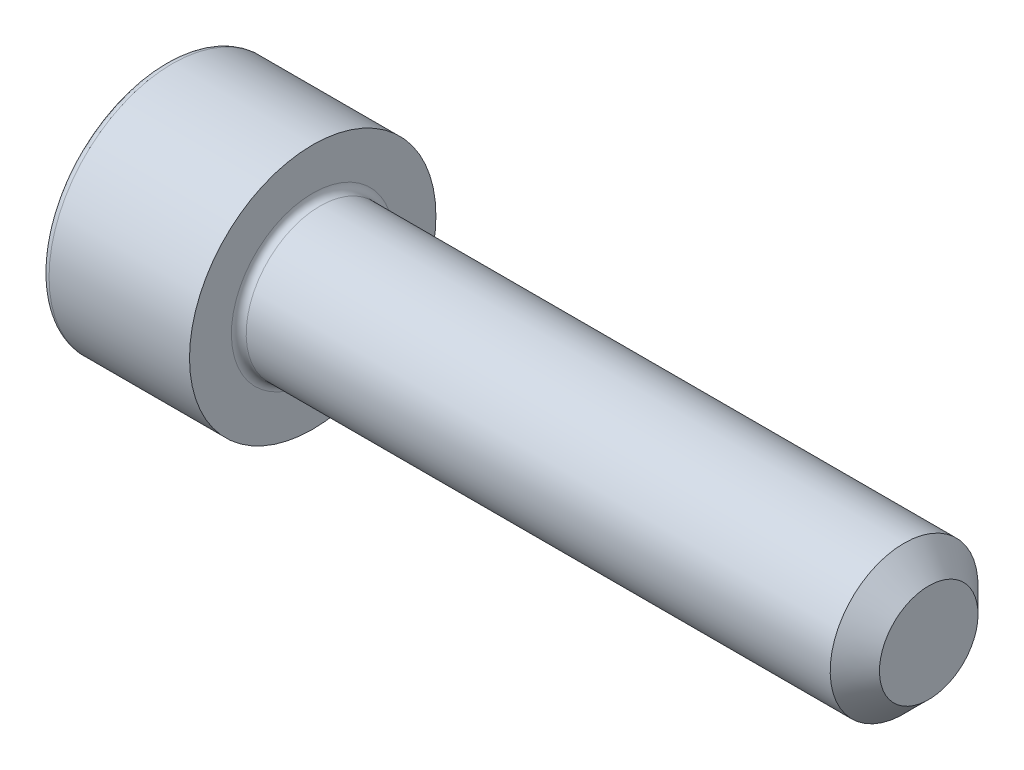
ISO-10303-21;
HEADER;
FILE_DESCRIPTION(('STEP AP214'),'2;1');
FILE_NAME('part.step','',(''),(''),'','','');
FILE_SCHEMA(('AUTOMOTIVE_DESIGN { 1 0 10303 214 1 1 1 1 }'));
ENDSEC;
DATA;
#1=APPLICATION_CONTEXT('core data for automotive mechanical design processes');
#2=APPLICATION_PROTOCOL_DEFINITION('international standard','automotive_design',2000,#1);
#3=PRODUCT_CONTEXT('',#1,'mechanical');
#4=PRODUCT('Part','Part','',(#3));
#5=PRODUCT_RELATED_PRODUCT_CATEGORY('part','',(#4));
#6=PRODUCT_DEFINITION_FORMATION('','',#4);
#7=PRODUCT_DEFINITION_CONTEXT('part definition',#1,'design');
#8=PRODUCT_DEFINITION('design','',#6,#7);
#9=PRODUCT_DEFINITION_SHAPE('','',#8);
#10=(LENGTH_UNIT() NAMED_UNIT(*) SI_UNIT(.MILLI.,.METRE.));
#11=(NAMED_UNIT(*) PLANE_ANGLE_UNIT() SI_UNIT($,.RADIAN.));
#12=(NAMED_UNIT(*) SI_UNIT($,.STERADIAN.) SOLID_ANGLE_UNIT());
#13=UNCERTAINTY_MEASURE_WITH_UNIT(LENGTH_MEASURE(1.E-05),#10,'distance_accuracy_value','');
#14=(GEOMETRIC_REPRESENTATION_CONTEXT(3) GLOBAL_UNCERTAINTY_ASSIGNED_CONTEXT((#13)) GLOBAL_UNIT_ASSIGNED_CONTEXT((#10,
#11,#12)) REPRESENTATION_CONTEXT('',''));
#15=CARTESIAN_POINT('',(0.,0.,0.));
#16=DIRECTION('',(0.,0.,1.));
#17=DIRECTION('',(1.,0.,0.));
#18=AXIS2_PLACEMENT_3D('',#15,#16,#17);
#19=CARTESIAN_POINT('',(0.,0.,0.));
#20=DIRECTION('',(-1.,0.,0.));
#21=DIRECTION('',(0.,-1.,0.));
#22=AXIS2_PLACEMENT_3D('',#19,#20,#21);
#23=PLANE('',#22);
#24=CARTESIAN_POINT('',(0.,0.,0.));
#25=DIRECTION('',(-1.,0.,0.));
#26=DIRECTION('',(0.,-1.,0.));
#27=AXIS2_PLACEMENT_3D('',#24,#25,#26);
#28=CIRCLE('',#27,4.7);
#29=CARTESIAN_POINT('',(0.,-4.7,0.));
#30=VERTEX_POINT('',#29);
#31=EDGE_CURVE('E158',#30,#30,#28,.T.);
#32=ORIENTED_EDGE('',*,*,#31,.T.);
#33=EDGE_LOOP('',(#32));
#34=FACE_BOUND('',#33,.T.);
#35=DIRECTION('',(0.,0.,-1.));
#36=VECTOR('',#35,1.);
#37=CARTESIAN_POINT('',(0.,2.5,1.44337567297407));
#38=LINE('',#37,#36);
#39=CARTESIAN_POINT('',(0.,2.5,1.44337567297407));
#40=VERTEX_POINT('',#39);
#41=CARTESIAN_POINT('',(0.,2.5,-1.44337567297406));
#42=VERTEX_POINT('',#41);
#43=EDGE_CURVE('E54',#40,#42,#38,.T.);
#44=ORIENTED_EDGE('',*,*,#43,.F.);
#45=DIRECTION('',(0.,0.866025403784439,-0.5));
#46=VECTOR('',#45,1.);
#47=CARTESIAN_POINT('',(0.,0.,2.88675134594813));
#48=LINE('',#47,#46);
#49=CARTESIAN_POINT('',(0.,0.,2.88675134594813));
#50=VERTEX_POINT('',#49);
#51=EDGE_CURVE('E137',#50,#40,#48,.T.);
#52=ORIENTED_EDGE('',*,*,#51,.F.);
#53=DIRECTION('',(0.,0.866025403784439,0.5));
#54=VECTOR('',#53,1.);
#55=CARTESIAN_POINT('',(0.,-2.5,1.44337567297406));
#56=LINE('',#55,#54);
#57=CARTESIAN_POINT('',(0.,-2.5,1.44337567297406));
#58=VERTEX_POINT('',#57);
#59=EDGE_CURVE('E135',#58,#50,#56,.T.);
#60=ORIENTED_EDGE('',*,*,#59,.F.);
#61=DIRECTION('',(0.,0.,1.));
#62=VECTOR('',#61,1.);
#63=CARTESIAN_POINT('',(0.,-2.5,-1.44337567297407));
#64=LINE('',#63,#62);
#65=CARTESIAN_POINT('',(0.,-2.5,-1.44337567297407));
#66=VERTEX_POINT('',#65);
#67=EDGE_CURVE('E102',#66,#58,#64,.T.);
#68=ORIENTED_EDGE('',*,*,#67,.F.);
#69=DIRECTION('',(0.,-0.866025403784439,0.5));
#70=VECTOR('',#69,1.);
#71=CARTESIAN_POINT('',(0.,0.,-2.88675134594813));
#72=LINE('',#71,#70);
#73=CARTESIAN_POINT('',(0.,0.,-2.88675134594813));
#74=VERTEX_POINT('',#73);
#75=EDGE_CURVE('E131',#74,#66,#72,.T.);
#76=ORIENTED_EDGE('',*,*,#75,.F.);
#77=DIRECTION('',(0.,-0.866025403784439,-0.5));
#78=VECTOR('',#77,1.);
#79=CARTESIAN_POINT('',(0.,2.5,-1.44337567297406));
#80=LINE('',#79,#78);
#81=EDGE_CURVE('E128',#42,#74,#80,.T.);
#82=ORIENTED_EDGE('',*,*,#81,.F.);
#83=EDGE_LOOP('',(#44,#52,#60,#68,#76,#82));
#84=FACE_BOUND('',#83,.T.);
#85=ADVANCED_FACE('F38',(#34,#84),#23,.T.);
#86=CARTESIAN_POINT('',(31.,0.,0.));
#87=DIRECTION('',(1.,0.,0.));
#88=DIRECTION('',(0.,1.,0.));
#89=AXIS2_PLACEMENT_3D('',#86,#87,#88);
#90=CYLINDRICAL_SURFACE('',#89,5.);
#91=CARTESIAN_POINT('',(0.300000000000002,0.,0.));
#92=DIRECTION('',(-1.,0.,0.));
#93=DIRECTION('',(0.,-1.,0.));
#94=AXIS2_PLACEMENT_3D('',#91,#92,#93);
#95=CIRCLE('',#94,5.);
#96=CARTESIAN_POINT('',(0.300000000000002,-5.,0.));
#97=VERTEX_POINT('',#96);
#98=EDGE_CURVE('E155',#97,#97,#95,.F.);
#99=ORIENTED_EDGE('',*,*,#98,.T.);
#100=EDGE_LOOP('',(#99));
#101=FACE_BOUND('',#100,.T.);
#102=CARTESIAN_POINT('',(6.,0.,0.));
#103=DIRECTION('',(1.,0.,0.));
#104=DIRECTION('',(0.,1.,0.));
#105=AXIS2_PLACEMENT_3D('',#102,#103,#104);
#106=CIRCLE('',#105,5.);
#107=CARTESIAN_POINT('',(6.,5.,0.));
#108=VERTEX_POINT('',#107);
#109=EDGE_CURVE('E141',#108,#108,#106,.T.);
#110=ORIENTED_EDGE('',*,*,#109,.F.);
#111=EDGE_LOOP('',(#110));
#112=FACE_BOUND('',#111,.T.);
#113=ADVANCED_FACE('F175',(#101,#112),#90,.T.);
#114=CARTESIAN_POINT('',(6.,5.,0.));
#115=DIRECTION('',(1.,0.,0.));
#116=DIRECTION('',(0.,1.,0.));
#117=AXIS2_PLACEMENT_3D('',#114,#115,#116);
#118=PLANE('',#117);
#119=CARTESIAN_POINT('',(6.,0.,0.));
#120=DIRECTION('',(1.,0.,0.));
#121=DIRECTION('',(0.,1.,0.));
#122=AXIS2_PLACEMENT_3D('',#119,#120,#121);
#123=CIRCLE('',#122,3.29999999999999);
#124=CARTESIAN_POINT('',(6.,3.3,0.));
#125=VERTEX_POINT('',#124);
#126=EDGE_CURVE('E152',#125,#125,#123,.F.);
#127=ORIENTED_EDGE('',*,*,#126,.T.);
#128=EDGE_LOOP('',(#127));
#129=FACE_BOUND('',#128,.T.);
#130=ORIENTED_EDGE('',*,*,#109,.T.);
#131=EDGE_LOOP('',(#130));
#132=FACE_BOUND('',#131,.T.);
#133=ADVANCED_FACE('F181',(#129,#132),#118,.T.);
#134=CARTESIAN_POINT('',(31.,0.,0.));
#135=DIRECTION('',(1.,0.,0.));
#136=DIRECTION('',(0.,1.,0.));
#137=AXIS2_PLACEMENT_3D('',#134,#135,#136);
#138=CYLINDRICAL_SURFACE('',#137,2.99999999999999);
#139=CARTESIAN_POINT('',(30.,0.,0.));
#140=DIRECTION('',(1.,0.,0.));
#141=DIRECTION('',(0.,1.,0.));
#142=AXIS2_PLACEMENT_3D('',#139,#140,#141);
#143=CIRCLE('',#142,2.99999999999999);
#144=CARTESIAN_POINT('',(30.,3.,0.));
#145=VERTEX_POINT('',#144);
#146=EDGE_CURVE('E11',#145,#145,#143,.F.);
#147=ORIENTED_EDGE('',*,*,#146,.T.);
#148=EDGE_LOOP('',(#147));
#149=FACE_BOUND('',#148,.T.);
#150=CARTESIAN_POINT('',(6.3,0.,0.));
#151=DIRECTION('',(1.,0.,0.));
#152=DIRECTION('',(0.,1.,0.));
#153=AXIS2_PLACEMENT_3D('',#150,#151,#152);
#154=CIRCLE('',#153,2.99999999999999);
#155=CARTESIAN_POINT('',(6.3,3.,0.));
#156=VERTEX_POINT('',#155);
#157=EDGE_CURVE('E149',#156,#156,#154,.T.);
#158=ORIENTED_EDGE('',*,*,#157,.T.);
#159=EDGE_LOOP('',(#158));
#160=FACE_BOUND('',#159,.T.);
#161=ADVANCED_FACE('F198',(#149,#160),#138,.T.);
#162=CARTESIAN_POINT('',(31.,3.,0.));
#163=DIRECTION('',(1.,0.,0.));
#164=DIRECTION('',(0.,1.,0.));
#165=AXIS2_PLACEMENT_3D('',#162,#163,#164);
#166=PLANE('',#165);
#167=CARTESIAN_POINT('',(31.,0.,0.));
#168=DIRECTION('',(1.,0.,0.));
#169=DIRECTION('',(0.,1.,0.));
#170=AXIS2_PLACEMENT_3D('',#167,#168,#169);
#171=CIRCLE('',#170,2.);
#172=CARTESIAN_POINT('',(31.,2.00000000000001,0.));
#173=VERTEX_POINT('',#172);
#174=EDGE_CURVE('E47',#173,#173,#171,.T.);
#175=ORIENTED_EDGE('',*,*,#174,.T.);
#176=EDGE_LOOP('',(#175));
#177=FACE_BOUND('',#176,.T.);
#178=ADVANCED_FACE('F163',(#177),#166,.T.);
#179=CARTESIAN_POINT('',(2.5,2.5,1.44337567297407));
#180=DIRECTION('',(0.,1.,0.));
#181=DIRECTION('',(-1.,0.,0.));
#182=AXIS2_PLACEMENT_3D('',#179,#180,#181);
#183=PLANE('',#182);
#184=ORIENTED_EDGE('',*,*,#43,.T.);
#185=DIRECTION('',(-1.,0.,0.));
#186=VECTOR('',#185,1.);
#187=CARTESIAN_POINT('',(2.5,2.5,-1.44337567297406));
#188=LINE('',#187,#186);
#189=CARTESIAN_POINT('',(2.5,2.5,-1.44337567297406));
#190=VERTEX_POINT('',#189);
#191=EDGE_CURVE('E84',#190,#42,#188,.T.);
#192=ORIENTED_EDGE('',*,*,#191,.F.);
#193=DIRECTION('',(0.,0.,-1.));
#194=VECTOR('',#193,1.);
#195=CARTESIAN_POINT('',(2.5,2.5,1.44337567297407));
#196=LINE('',#195,#194);
#197=CARTESIAN_POINT('',(2.5,2.5,1.44337567297407));
#198=VERTEX_POINT('',#197);
#199=EDGE_CURVE('E139',#198,#190,#196,.T.);
#200=ORIENTED_EDGE('',*,*,#199,.F.);
#201=DIRECTION('',(-1.,0.,0.));
#202=VECTOR('',#201,1.);
#203=CARTESIAN_POINT('',(2.5,2.5,1.44337567297407));
#204=LINE('',#203,#202);
#205=EDGE_CURVE('E62',#198,#40,#204,.T.);
#206=ORIENTED_EDGE('',*,*,#205,.T.);
#207=EDGE_LOOP('',(#184,#192,#200,#206));
#208=FACE_BOUND('',#207,.T.);
#209=ADVANCED_FACE('F206',(#208),#183,.F.);
#210=CARTESIAN_POINT('',(2.5,0.,2.88675134594813));
#211=DIRECTION('',(0.,0.5,0.866025403784439));
#212=DIRECTION('',(0.,-0.866025403784439,0.5));
#213=AXIS2_PLACEMENT_3D('',#210,#211,#212);
#214=PLANE('',#213);
#215=ORIENTED_EDGE('',*,*,#51,.T.);
#216=ORIENTED_EDGE('',*,*,#205,.F.);
#217=DIRECTION('',(0.,0.866025403784439,-0.5));
#218=VECTOR('',#217,1.);
#219=CARTESIAN_POINT('',(2.5,0.,2.88675134594813));
#220=LINE('',#219,#218);
#221=CARTESIAN_POINT('',(2.5,0.,2.88675134594813));
#222=VERTEX_POINT('',#221);
#223=EDGE_CURVE('E114',#222,#198,#220,.T.);
#224=ORIENTED_EDGE('',*,*,#223,.F.);
#225=DIRECTION('',(-1.,0.,0.));
#226=VECTOR('',#225,1.);
#227=CARTESIAN_POINT('',(2.5,0.,2.88675134594813));
#228=LINE('',#227,#226);
#229=EDGE_CURVE('E106',#222,#50,#228,.T.);
#230=ORIENTED_EDGE('',*,*,#229,.T.);
#231=EDGE_LOOP('',(#215,#216,#224,#230));
#232=FACE_BOUND('',#231,.T.);
#233=ADVANCED_FACE('F212',(#232),#214,.F.);
#234=CARTESIAN_POINT('',(2.5,-2.5,1.44337567297406));
#235=DIRECTION('',(0.,-0.5,0.866025403784439));
#236=DIRECTION('',(0.,-0.866025403784439,-0.5));
#237=AXIS2_PLACEMENT_3D('',#234,#235,#236);
#238=PLANE('',#237);
#239=ORIENTED_EDGE('',*,*,#59,.T.);
#240=ORIENTED_EDGE('',*,*,#229,.F.);
#241=DIRECTION('',(0.,0.866025403784439,0.5));
#242=VECTOR('',#241,1.);
#243=CARTESIAN_POINT('',(2.5,-2.5,1.44337567297406));
#244=LINE('',#243,#242);
#245=CARTESIAN_POINT('',(2.5,-2.5,1.44337567297406));
#246=VERTEX_POINT('',#245);
#247=EDGE_CURVE('E110',#246,#222,#244,.T.);
#248=ORIENTED_EDGE('',*,*,#247,.F.);
#249=DIRECTION('',(-1.,0.,0.));
#250=VECTOR('',#249,1.);
#251=CARTESIAN_POINT('',(2.5,-2.5,1.44337567297406));
#252=LINE('',#251,#250);
#253=EDGE_CURVE('E95',#246,#58,#252,.T.);
#254=ORIENTED_EDGE('',*,*,#253,.T.);
#255=EDGE_LOOP('',(#239,#240,#248,#254));
#256=FACE_BOUND('',#255,.T.);
#257=ADVANCED_FACE('F111',(#256),#238,.F.);
#258=CARTESIAN_POINT('',(2.5,-2.5,-1.44337567297407));
#259=DIRECTION('',(0.,-1.,0.));
#260=DIRECTION('',(1.,0.,0.));
#261=AXIS2_PLACEMENT_3D('',#258,#259,#260);
#262=PLANE('',#261);
#263=ORIENTED_EDGE('',*,*,#67,.T.);
#264=ORIENTED_EDGE('',*,*,#253,.F.);
#265=DIRECTION('',(0.,0.,1.));
#266=VECTOR('',#265,1.);
#267=CARTESIAN_POINT('',(2.5,-2.5,-1.44337567297407));
#268=LINE('',#267,#266);
#269=CARTESIAN_POINT('',(2.5,-2.5,-1.44337567297407));
#270=VERTEX_POINT('',#269);
#271=EDGE_CURVE('E99',#270,#246,#268,.T.);
#272=ORIENTED_EDGE('',*,*,#271,.F.);
#273=DIRECTION('',(-1.,0.,0.));
#274=VECTOR('',#273,1.);
#275=CARTESIAN_POINT('',(2.5,-2.5,-1.44337567297407));
#276=LINE('',#275,#274);
#277=EDGE_CURVE('E107',#270,#66,#276,.T.);
#278=ORIENTED_EDGE('',*,*,#277,.T.);
#279=EDGE_LOOP('',(#263,#264,#272,#278));
#280=FACE_BOUND('',#279,.T.);
#281=ADVANCED_FACE('F97',(#280),#262,.F.);
#282=CARTESIAN_POINT('',(2.5,0.,-2.88675134594813));
#283=DIRECTION('',(0.,-0.5,-0.866025403784439));
#284=DIRECTION('',(0.,0.866025403784439,-0.5));
#285=AXIS2_PLACEMENT_3D('',#282,#283,#284);
#286=PLANE('',#285);
#287=ORIENTED_EDGE('',*,*,#75,.T.);
#288=ORIENTED_EDGE('',*,*,#277,.F.);
#289=DIRECTION('',(0.,-0.866025403784439,0.5));
#290=VECTOR('',#289,1.);
#291=CARTESIAN_POINT('',(2.5,0.,-2.88675134594813));
#292=LINE('',#291,#290);
#293=CARTESIAN_POINT('',(2.5,0.,-2.88675134594813));
#294=VERTEX_POINT('',#293);
#295=EDGE_CURVE('E120',#294,#270,#292,.T.);
#296=ORIENTED_EDGE('',*,*,#295,.F.);
#297=DIRECTION('',(-1.,0.,0.));
#298=VECTOR('',#297,1.);
#299=CARTESIAN_POINT('',(2.5,0.,-2.88675134594813));
#300=LINE('',#299,#298);
#301=EDGE_CURVE('E144',#294,#74,#300,.T.);
#302=ORIENTED_EDGE('',*,*,#301,.T.);
#303=EDGE_LOOP('',(#287,#288,#296,#302));
#304=FACE_BOUND('',#303,.T.);
#305=ADVANCED_FACE('F215',(#304),#286,.F.);
#306=CARTESIAN_POINT('',(2.5,2.5,-1.44337567297406));
#307=DIRECTION('',(0.,0.5,-0.866025403784439));
#308=DIRECTION('',(0.,0.866025403784439,0.5));
#309=AXIS2_PLACEMENT_3D('',#306,#307,#308);
#310=PLANE('',#309);
#311=ORIENTED_EDGE('',*,*,#81,.T.);
#312=ORIENTED_EDGE('',*,*,#301,.F.);
#313=DIRECTION('',(0.,-0.866025403784439,-0.5));
#314=VECTOR('',#313,1.);
#315=CARTESIAN_POINT('',(2.5,2.5,-1.44337567297406));
#316=LINE('',#315,#314);
#317=EDGE_CURVE('E122',#190,#294,#316,.T.);
#318=ORIENTED_EDGE('',*,*,#317,.F.);
#319=ORIENTED_EDGE('',*,*,#191,.T.);
#320=EDGE_LOOP('',(#311,#312,#318,#319));
#321=FACE_BOUND('',#320,.T.);
#322=ADVANCED_FACE('F192',(#321),#310,.F.);
#323=CARTESIAN_POINT('',(2.5,0.,0.));
#324=DIRECTION('',(-1.,0.,0.));
#325=DIRECTION('',(0.,-1.,0.));
#326=AXIS2_PLACEMENT_3D('',#323,#324,#325);
#327=PLANE('',#326);
#328=ORIENTED_EDGE('',*,*,#199,.T.);
#329=ORIENTED_EDGE('',*,*,#317,.T.);
#330=ORIENTED_EDGE('',*,*,#295,.T.);
#331=ORIENTED_EDGE('',*,*,#271,.T.);
#332=ORIENTED_EDGE('',*,*,#247,.T.);
#333=ORIENTED_EDGE('',*,*,#223,.T.);
#334=EDGE_LOOP('',(#328,#329,#330,#331,#332,#333));
#335=FACE_BOUND('',#334,.T.);
#336=ADVANCED_FACE('F117',(#335),#327,.T.);
#337=CARTESIAN_POINT('',(6.3,0.,0.));
#338=DIRECTION('',(1.,0.,0.));
#339=DIRECTION('',(0.,1.,0.));
#340=AXIS2_PLACEMENT_3D('',#337,#338,#339);
#341=TOROIDAL_SURFACE('',#340,3.29999999999999,0.3);
#342=ORIENTED_EDGE('',*,*,#126,.F.);
#343=EDGE_LOOP('',(#342));
#344=FACE_BOUND('',#343,.T.);
#345=ORIENTED_EDGE('',*,*,#157,.F.);
#346=EDGE_LOOP('',(#345));
#347=FACE_BOUND('',#346,.T.);
#348=ADVANCED_FACE('F171',(#344,#347),#341,.F.);
#349=CARTESIAN_POINT('',(0.300000000000002,0.,0.));
#350=DIRECTION('',(-1.,0.,0.));
#351=DIRECTION('',(0.,-1.,0.));
#352=AXIS2_PLACEMENT_3D('',#349,#350,#351);
#353=TOROIDAL_SURFACE('',#352,4.7,0.3);
#354=ORIENTED_EDGE('',*,*,#31,.F.);
#355=EDGE_LOOP('',(#354));
#356=FACE_BOUND('',#355,.T.);
#357=ORIENTED_EDGE('',*,*,#98,.F.);
#358=EDGE_LOOP('',(#357));
#359=FACE_BOUND('',#358,.T.);
#360=ADVANCED_FACE('F166',(#356,#359),#353,.T.);
#361=CARTESIAN_POINT('',(31.,0.,0.));
#362=DIRECTION('',(-1.,0.,0.));
#363=DIRECTION('',(0.,-1.,0.));
#364=AXIS2_PLACEMENT_3D('',#361,#362,#363);
#365=CONICAL_SURFACE('',#364,2.,0.785398163397445);
#366=ORIENTED_EDGE('',*,*,#146,.F.);
#367=EDGE_LOOP('',(#366));
#368=FACE_BOUND('',#367,.T.);
#369=ORIENTED_EDGE('',*,*,#174,.F.);
#370=EDGE_LOOP('',(#369));
#371=FACE_BOUND('',#370,.T.);
#372=ADVANCED_FACE('F41',(#368,#371),#365,.T.);
#373=CLOSED_SHELL('',(#85,#113,#133,#161,#178,#209,#233,#257,#281,#305,#322,#336,#348,#360,#372));
#374=MANIFOLD_SOLID_BREP('B2',#373);
#375=ADVANCED_BREP_SHAPE_REPRESENTATION('',(#18,#374),#14);
#376=SHAPE_DEFINITION_REPRESENTATION(#9,#375);
ENDSEC;
END-ISO-10303-21;
